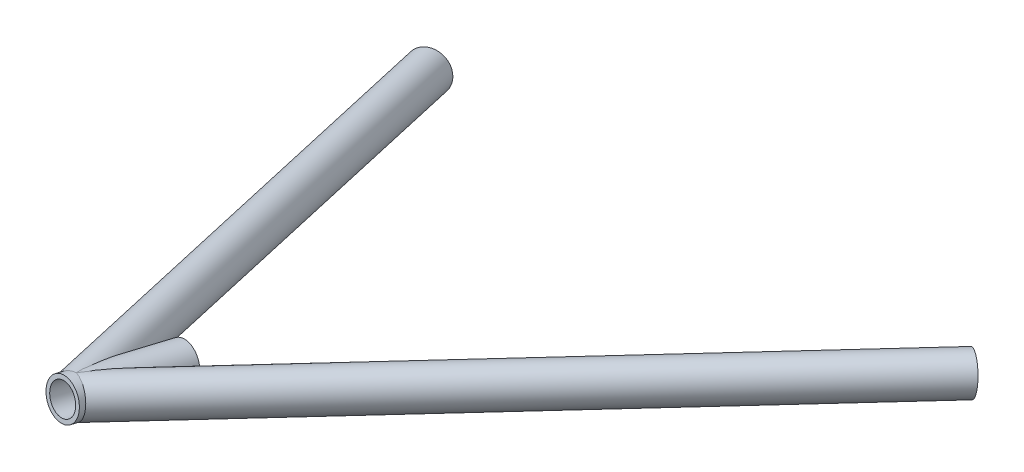
ISO-10303-21;
HEADER;
FILE_DESCRIPTION(('STEP AP214'),'2;1');
FILE_NAME('part.step','',(''),(''),'','','');
FILE_SCHEMA(('AUTOMOTIVE_DESIGN { 1 0 10303 214 1 1 1 1 }'));
ENDSEC;
DATA;
#1=APPLICATION_CONTEXT('core data for automotive mechanical design processes');
#2=APPLICATION_PROTOCOL_DEFINITION('international standard','automotive_design',2000,#1);
#3=PRODUCT_CONTEXT('',#1,'mechanical');
#4=PRODUCT('Part','Part','',(#3));
#5=PRODUCT_RELATED_PRODUCT_CATEGORY('part','',(#4));
#6=PRODUCT_DEFINITION_FORMATION('','',#4);
#7=PRODUCT_DEFINITION_CONTEXT('part definition',#1,'design');
#8=PRODUCT_DEFINITION('design','',#6,#7);
#9=PRODUCT_DEFINITION_SHAPE('','',#8);
#10=(LENGTH_UNIT() NAMED_UNIT(*) SI_UNIT(.MILLI.,.METRE.));
#11=(NAMED_UNIT(*) PLANE_ANGLE_UNIT() SI_UNIT($,.RADIAN.));
#12=(NAMED_UNIT(*) SI_UNIT($,.STERADIAN.) SOLID_ANGLE_UNIT());
#13=UNCERTAINTY_MEASURE_WITH_UNIT(LENGTH_MEASURE(1.E-05),#10,'distance_accuracy_value','');
#14=(GEOMETRIC_REPRESENTATION_CONTEXT(3) GLOBAL_UNCERTAINTY_ASSIGNED_CONTEXT((#13)) GLOBAL_UNIT_ASSIGNED_CONTEXT((#10,
#11,#12)) REPRESENTATION_CONTEXT('',''));
#15=CARTESIAN_POINT('',(0.,0.,0.));
#16=DIRECTION('',(0.,0.,1.));
#17=DIRECTION('',(1.,0.,0.));
#18=AXIS2_PLACEMENT_3D('',#15,#16,#17);
#19=CARTESIAN_POINT('',(4.04397858951075,301.981612494775,650.872201759846));
#20=DIRECTION('',(0.537160814672258,-0.118768279923982,-0.835076256915819));
#21=DIRECTION('',(-0.841029061630512,0.,-0.540989942136544));
#22=AXIS2_PLACEMENT_3D('',#19,#20,#21);
#23=CYLINDRICAL_SURFACE('',#22,7.41679999999997);
#24=CARTESIAN_POINT('',(181.199371486471,262.811887676954,375.464431215176));
#25=DIRECTION('',(-0.537160814672258,0.118768279923982,0.835076256915819));
#26=DIRECTION('',(0.841029061630512,0.,0.540989942136543));
#27=AXIS2_PLACEMENT_3D('',#24,#25,#26);
#28=CIRCLE('',#27,7.41679999999997);
#29=CARTESIAN_POINT('',(187.437115830772,262.811887676954,379.476845418014));
#30=VERTEX_POINT('',#29);
#31=EDGE_CURVE('E109',#30,#30,#28,.T.);
#32=ORIENTED_EDGE('',*,*,#31,.F.);
#33=EDGE_LOOP('',(#32));
#34=FACE_BOUND('',#33,.T.);
#35=CARTESIAN_POINT('',(18.0259893730203,297.510948456335,615.425928335186));
#36=CARTESIAN_POINT('',(18.0392009230547,297.391181249334,615.4053989557));
#37=CARTESIAN_POINT('',(18.049379106641,297.269192682269,615.394643104518));
#38=CARTESIAN_POINT('',(18.0623771955097,297.024848893247,615.395952968748));
#39=CARTESIAN_POINT('',(18.06519601463,296.902493619836,615.408022052419));
#40=CARTESIAN_POINT('',(18.0631446437854,296.662477211055,615.455138321569));
#41=CARTESIAN_POINT('',(18.0582796529336,296.544812956811,615.490169960463));
#42=CARTESIAN_POINT('',(18.0416756858454,296.317868608693,615.58008254422));
#43=CARTESIAN_POINT('',(18.0299260387503,296.208601828507,615.634994251557));
#44=CARTESIAN_POINT('',(17.9965826357287,295.968773124247,615.778938372833));
#45=CARTESIAN_POINT('',(17.9730897345507,295.841710660102,615.873266291217));
#46=CARTESIAN_POINT('',(17.9197422240915,295.603899976413,616.078980624299));
#47=CARTESIAN_POINT('',(17.8898736862353,295.493188388632,616.190404234864));
#48=CARTESIAN_POINT('',(17.8275120366974,295.291093662526,616.418282505348));
#49=CARTESIAN_POINT('',(17.7952315748672,295.199011169215,616.534187563074));
#50=CARTESIAN_POINT('',(17.7279462334323,295.025261820128,616.772888114363));
#51=CARTESIAN_POINT('',(17.692938744839,294.943605140931,616.895690174271));
#52=CARTESIAN_POINT('',(17.620894661041,294.788818403219,617.146389147038));
#53=CARTESIAN_POINT('',(17.5838530632472,294.715710889433,617.274298388449));
#54=CARTESIAN_POINT('',(17.5083523726395,294.576878159229,617.53354024883));
#55=CARTESIAN_POINT('',(17.4698939088278,294.511149718176,617.664871341302));
#56=CARTESIAN_POINT('',(17.3656042528833,294.343650096037,618.019563112275));
#57=CARTESIAN_POINT('',(17.298801180808,294.24745909781,618.24526830367));
#58=CARTESIAN_POINT('',(17.1632389097918,294.068548963037,618.701432507359));
#59=CARTESIAN_POINT('',(17.0944785846952,293.985837774328,618.931894234593));
#60=CARTESIAN_POINT('',(16.9555367997195,293.831169639357,619.396480467915));
#61=CARTESIAN_POINT('',(16.8853528544155,293.759233744994,619.630611181744));
#62=CARTESIAN_POINT('',(16.7441163542546,293.624403841432,620.101208439363));
#63=CARTESIAN_POINT('',(16.6730636982798,293.561510895916,620.337675254449));
#64=CARTESIAN_POINT('',(16.5300291670172,293.443074322862,620.813551004494));
#65=CARTESIAN_POINT('',(16.458044393262,293.387570110842,621.052968813209));
#66=CARTESIAN_POINT('',(16.3137273383495,293.28322583845,621.53314758715));
#67=CARTESIAN_POINT('',(16.2413950423059,293.234386066235,621.773908609987));
#68=CARTESIAN_POINT('',(16.0243304399387,293.096696071643,622.497142697111));
#69=CARTESIAN_POINT('',(15.8793409293532,293.016523891741,622.981195597616));
#70=CARTESIAN_POINT('',(15.563202463854,292.861599362073,624.040978545665));
#71=CARTESIAN_POINT('',(15.3921278067244,292.790531373747,624.617256246227));
#72=CARTESIAN_POINT('',(15.0517610779049,292.669278219643,625.772592750415));
#73=CARTESIAN_POINT('',(14.8824693232943,292.619096709261,626.351652022929));
#74=CARTESIAN_POINT('',(14.546667293014,292.536462920992,627.512621813292));
#75=CARTESIAN_POINT('',(14.3801608537045,292.504033411516,628.094535031451));
#76=CARTESIAN_POINT('',(14.051431917114,292.454994085379,629.260174503447));
#77=CARTESIAN_POINT('',(13.8892090857078,292.4383830313,629.843900611884));
#78=CARTESIAN_POINT('',(13.5711219110217,292.419823964543,631.010997751313));
#79=CARTESIAN_POINT('',(13.4152362896875,292.417822003584,631.594362126013));
#80=CARTESIAN_POINT('',(13.1110723780713,292.427863543567,632.763005472116));
#81=CARTESIAN_POINT('',(12.962794721003,292.439908211642,633.348284598584));
#82=CARTESIAN_POINT('',(12.6765234996167,292.478257381376,634.520275832957));
#83=CARTESIAN_POINT('',(12.5385193019929,292.504546899102,635.106985791365));
#84=CARTESIAN_POINT('',(12.3417938870989,292.555556279288,635.988619697626));
#85=CARTESIAN_POINT('',(12.277936128261,292.574486948643,636.282739578099));
#86=CARTESIAN_POINT('',(12.1542433083895,292.616487327866,636.871525918635));
#87=CARTESIAN_POINT('',(12.0944081591793,292.639556946967,637.166192366571));
#88=CARTESIAN_POINT('',(11.9600289486346,292.698749171385,637.85572611667));
#89=CARTESIAN_POINT('',(11.8873456926771,292.736648454893,638.250810467152));
#90=CARTESIAN_POINT('',(11.7525274778548,292.821778631757,639.041866355432));
#91=CARTESIAN_POINT('',(11.6903943502096,292.869011142037,639.437838035187));
#92=CARTESIAN_POINT('',(11.5794750694732,292.974727860035,640.230313522759));
#93=CARTESIAN_POINT('',(11.5306913396657,293.033214107339,640.626817414077));
#94=CARTESIAN_POINT('',(11.470343554994,293.131539272535,641.221076182981));
#95=CARTESIAN_POINT('',(11.4523665530691,293.166076993828,641.419063215714));
#96=CARTESIAN_POINT('',(11.4212609410856,293.239185884249,641.814667454382));
#97=CARTESIAN_POINT('',(11.4081320379369,293.27775680937,642.012284681955));
#98=CARTESIAN_POINT('',(11.3836671576796,293.373983487733,642.476735145353));
#99=CARTESIAN_POINT('',(11.3746116949344,293.433561302975,642.743302696478));
#100=CARTESIAN_POINT('',(11.3682948089143,293.562972324594,643.274164444859));
#101=CARTESIAN_POINT('',(11.3710346788846,293.632806654688,643.538458389653));
#102=CARTESIAN_POINT('',(11.3901826404233,293.784818610712,644.062448751672));
#103=CARTESIAN_POINT('',(11.4065623411157,293.866970307445,644.322153575299));
#104=CARTESIAN_POINT('',(11.4547428616655,294.046367314067,644.834848924092));
#105=CARTESIAN_POINT('',(11.4865364051065,294.143605487367,645.087842558034));
#106=CARTESIAN_POINT('',(11.5549147493514,294.324768047379,645.510473998685));
#107=CARTESIAN_POINT('',(11.5873322808602,294.404182129703,645.682721295324));
#108=CARTESIAN_POINT('',(11.6604911919953,294.572921566891,646.020439354004));
#109=CARTESIAN_POINT('',(11.7012298817969,294.662243714708,646.18591228517));
#110=CARTESIAN_POINT('',(11.7906581033069,294.851549362705,646.508223893678));
#111=CARTESIAN_POINT('',(11.8393406372267,294.951523452854,646.665070009299));
#112=CARTESIAN_POINT('',(11.9438288702849,295.162741771333,646.968493413005));
#113=CARTESIAN_POINT('',(11.9996345085449,295.273985903342,647.115070788835));
#114=CARTESIAN_POINT('',(12.1173731324617,295.508672974601,647.39721363735));
#115=CARTESIAN_POINT('',(12.1793428592063,295.632189055164,647.532703077649));
#116=CARTESIAN_POINT('',(12.3072756051872,295.890609327443,647.790288659604));
#117=CARTESIAN_POINT('',(12.3732387464868,296.02551386731,647.912384391545));
#118=CARTESIAN_POINT('',(12.5071009026746,296.30622592416,648.14236901447));
#119=CARTESIAN_POINT('',(12.5750012948688,296.452041324178,648.250247475103));
#120=CARTESIAN_POINT('',(12.7105107236756,296.753620990599,648.451253342594));
#121=CARTESIAN_POINT('',(12.7781197686254,296.909384970267,648.54438117432));
#122=CARTESIAN_POINT('',(12.9053835786029,297.216345003063,648.708635413285));
#123=CARTESIAN_POINT('',(12.9652297478743,297.366827559972,648.780952279324));
#124=CARTESIAN_POINT('',(13.0814750650284,297.674352647588,648.913329403656));
#125=CARTESIAN_POINT('',(13.1378744622686,297.831394702358,648.973390549331));
#126=CARTESIAN_POINT('',(13.2459558550857,298.151114517152,649.081544727949));
#127=CARTESIAN_POINT('',(13.2976378372984,298.31379229314,649.129637726989));
#128=CARTESIAN_POINT('',(13.3952051458348,298.643841112701,649.214205400618));
#129=CARTESIAN_POINT('',(13.441090135971,298.811212427783,649.250679401568));
#130=CARTESIAN_POINT('',(13.5288574832356,299.160401496814,649.314323677058));
#131=CARTESIAN_POINT('',(13.5703029443316,299.342463296291,649.340759342042));
#132=CARTESIAN_POINT('',(13.6447657558027,299.70965408605,649.381328645444));
#133=CARTESIAN_POINT('',(13.6777828414342,299.894783172485,649.395461897466));
#134=CARTESIAN_POINT('',(13.7347467915508,300.26699078181,649.411812749685));
#135=CARTESIAN_POINT('',(13.758691794149,300.454069696784,649.414027905132));
#136=CARTESIAN_POINT('',(13.7970486877606,300.828982939074,649.406868787367));
#137=CARTESIAN_POINT('',(13.8114602965379,301.01681728859,649.397494171064));
#138=CARTESIAN_POINT('',(13.8309587333078,301.401581022214,649.366666461392));
#139=CARTESIAN_POINT('',(13.8355366740282,301.598489549477,649.34462604006));
#140=CARTESIAN_POINT('',(13.8337607085808,301.9905014218,649.288295516682));
#141=CARTESIAN_POINT('',(13.8274064049574,302.185604700969,649.254004969303));
#142=CARTESIAN_POINT('',(13.8038678608829,302.572672588593,649.173332003037));
#143=CARTESIAN_POINT('',(13.7866815731982,302.764636596692,649.126947299339));
#144=CARTESIAN_POINT('',(13.7417950399094,303.144007762921,649.022179296996));
#145=CARTESIAN_POINT('',(13.7140948250639,303.331414934382,648.963796033454));
#146=CARTESIAN_POINT('',(13.6483939375111,303.702122579301,648.834406375262));
#147=CARTESIAN_POINT('',(13.6102933945019,303.88536353833,648.76328001579));
#148=CARTESIAN_POINT('',(13.5247185082023,304.244338133499,648.608757825874));
#149=CARTESIAN_POINT('',(13.477244017158,304.420071651253,648.52536180204));
#150=CARTESIAN_POINT('',(13.373992291517,304.762569288793,648.346209796664));
#151=CARTESIAN_POINT('',(13.3182153847532,304.929333762381,648.250454303173));
#152=CARTESIAN_POINT('',(13.1997162137712,305.252448661401,648.046472659108));
#153=CARTESIAN_POINT('',(13.1369941772474,305.408799427974,647.938246917363));
#154=CARTESIAN_POINT('',(13.0079807472715,305.705736241056,647.712250351754));
#155=CARTESIAN_POINT('',(12.9418256091205,305.846627647483,647.59480319643));
#156=CARTESIAN_POINT('',(12.8063252704746,306.115959344151,647.348055863197));
#157=CARTESIAN_POINT('',(12.7369801487349,306.244399941537,647.218755977834));
#158=CARTESIAN_POINT('',(12.5972245605859,306.487624851574,646.948669395698));
#159=CARTESIAN_POINT('',(12.5268151987456,306.602422356299,646.807894020864));
#160=CARTESIAN_POINT('',(12.3870749633705,306.817660822114,646.515272129223));
#161=CARTESIAN_POINT('',(12.3177440058268,306.91810290655,646.363426480097));
#162=CARTESIAN_POINT('',(12.187204266398,307.097517916396,646.060748085196));
#163=CARTESIAN_POINT('',(12.1257689621684,307.177511507652,645.910616592422));
#164=CARTESIAN_POINT('',(12.0073617238849,307.324690296442,645.602541218296));
#165=CARTESIAN_POINT('',(11.9503894179186,307.391876561913,645.444597989707));
#166=CARTESIAN_POINT('',(11.8422612739717,307.513782780615,645.122088728321));
#167=CARTESIAN_POINT('',(11.7911047326352,307.568504242139,644.957523499652));
#168=CARTESIAN_POINT('',(11.6955621068052,307.666185719994,644.623031226127));
#169=CARTESIAN_POINT('',(11.6511769529345,307.709144120317,644.453103448139));
#170=CARTESIAN_POINT('',(11.5562273899794,307.796714592838,644.052034572754));
#171=CARTESIAN_POINT('',(11.508504229024,307.83714011634,643.819301773671));
#172=CARTESIAN_POINT('',(11.426372932171,307.901437123905,643.349259932401));
#173=CARTESIAN_POINT('',(11.3919700818443,307.925302039599,643.111949112764));
#174=CARTESIAN_POINT('',(11.3357964940907,307.959215673984,642.63434225165));
#175=CARTESIAN_POINT('',(11.3140562593375,307.96923111001,642.394040414363));
#176=CARTESIAN_POINT('',(11.2822138290264,307.977808650157,641.912553650223));
#177=CARTESIAN_POINT('',(11.2721103959542,307.97637197228,641.67136882001));
#178=CARTESIAN_POINT('',(11.2609650047204,307.9626033566,641.127982475222));
#179=CARTESIAN_POINT('',(11.2628654957441,307.947604593592,640.825795463397));
#180=CARTESIAN_POINT('',(11.2803047822254,307.906164362887,640.222546893591));
#181=CARTESIAN_POINT('',(11.2958500310743,307.879717483717,639.921485935857));
#182=CARTESIAN_POINT('',(11.3383398883103,307.817706795311,639.320600353298));
#183=CARTESIAN_POINT('',(11.3653050759216,307.782126573212,639.02077895199));
#184=CARTESIAN_POINT('',(11.4287010459255,307.703622419329,638.42318343931));
#185=CARTESIAN_POINT('',(11.4651303890478,307.660699604515,638.125409023702));
#186=CARTESIAN_POINT('',(11.5462096236828,307.568378875036,637.529410987154));
#187=CARTESIAN_POINT('',(11.5909257767127,307.518929765035,637.231204472079));
#188=CARTESIAN_POINT('',(11.6870548657426,307.414766469799,636.636803034188));
#189=CARTESIAN_POINT('',(11.7384679733657,307.360052149641,636.340608163129));
#190=CARTESIAN_POINT('',(11.8468591948296,307.24609197885,635.750486583504));
#191=CARTESIAN_POINT('',(11.9038308719929,307.186851386371,635.456557666955));
#192=CARTESIAN_POINT('',(12.0225233012161,307.064259457315,634.870528460908));
#193=CARTESIAN_POINT('',(12.0842440531249,307.000908120869,634.578428171352));
#194=CARTESIAN_POINT('',(12.2184611596817,306.863538311854,633.965181365808));
#195=CARTESIAN_POINT('',(12.2914069656672,306.789100061657,633.644227508919));
#196=CARTESIAN_POINT('',(12.441461988527,306.635913534411,633.004324054833));
#197=CARTESIAN_POINT('',(12.5185713428966,306.557165115023,632.685374524215));
#198=CARTESIAN_POINT('',(12.7551826990239,306.314740685158,631.731315983409));
#199=CARTESIAN_POINT('',(12.9199521729491,306.144901487568,631.099067891332));
#200=CARTESIAN_POINT('',(13.2599677612956,305.788975297079,629.840756650357));
#201=CARTESIAN_POINT('',(13.4352318327593,305.602860189012,629.214706369674));
#202=CARTESIAN_POINT('',(13.7932579710048,305.214016232643,627.970038393295));
#203=CARTESIAN_POINT('',(13.9760191405481,305.011289369524,627.351419819577));
#204=CARTESIAN_POINT('',(14.3452017680405,304.589678406339,626.128069053151));
#205=CARTESIAN_POINT('',(14.5315701650489,304.370971109374,625.523260275809));
#206=CARTESIAN_POINT('',(14.8139307637117,304.02745668686,624.6227274501));
#207=CARTESIAN_POINT('',(14.9085343518049,303.910356292052,624.323615826375));
#208=CARTESIAN_POINT('',(15.0984779122026,303.670518834585,623.727900343464));
#209=CARTESIAN_POINT('',(15.1938178634639,303.547781932507,623.431296413119));
#210=CARTESIAN_POINT('',(15.3848279575733,303.296351351947,622.841565050507));
#211=CARTESIAN_POINT('',(15.480496914537,303.167671355233,622.548431411254));
#212=CARTESIAN_POINT('',(15.6721587563683,302.903352225973,621.965436136662));
#213=CARTESIAN_POINT('',(15.7681516240351,302.767713457694,621.675574331022));
#214=CARTESIAN_POINT('',(15.9601786521053,302.488559756385,621.099861321316));
#215=CARTESIAN_POINT('',(16.0562127698196,302.345048680094,620.814008238013));
#216=CARTESIAN_POINT('',(16.2480657583436,302.048824611076,620.247057412478));
#217=CARTESIAN_POINT('',(16.3438846562762,301.896112854182,619.965959038063));
#218=CARTESIAN_POINT('',(16.5007724105263,301.636276128116,619.509191365899));
#219=CARTESIAN_POINT('',(16.5620197729741,301.532368346773,619.331752716318));
#220=CARTESIAN_POINT('',(16.6841330910256,301.31939311484,618.979814257614));
#221=CARTESIAN_POINT('',(16.7449989877478,301.210324888888,618.805314895497));
#222=CARTESIAN_POINT('',(16.8664289891661,300.98577901384,618.459144789293));
#223=CARTESIAN_POINT('',(16.9269904759811,300.870274557181,618.287490448721));
#224=CARTESIAN_POINT('',(17.0472615114838,300.63234713766,617.948769242178));
#225=CARTESIAN_POINT('',(17.1069712313438,300.509925590115,617.781701448066));
#226=CARTESIAN_POINT('',(17.2258774278961,300.25536827208,617.451488817069));
#227=CARTESIAN_POINT('',(17.2850595415654,300.123134945401,617.288413504024));
#228=CARTESIAN_POINT('',(17.4016610311343,299.848347429108,616.97013954836));
#229=CARTESIAN_POINT('',(17.4590786464364,299.705783379173,616.81494867798));
#230=CARTESIAN_POINT('',(17.5708662190597,299.408832466774,616.516614372798));
#231=CARTESIAN_POINT('',(17.6252497345914,299.254506976522,616.373415617786));
#232=CARTESIAN_POINT('',(17.7295842627494,298.930641743062,616.103831748072));
#233=CARTESIAN_POINT('',(17.7795458072694,298.761140196122,615.977406304535));
#234=CARTESIAN_POINT('',(17.86111838538,298.446195118441,615.777748005667));
#235=CARTESIAN_POINT('',(17.8942611916319,298.304685323759,615.69902386072));
#236=CARTESIAN_POINT('',(17.953971389663,298.010431036427,615.563990476506));
#237=CARTESIAN_POINT('',(17.9805769467949,297.857758849595,615.507549908532));
#238=CARTESIAN_POINT('',(18.0110423998854,297.638002947985,615.450592182051));
#239=CARTESIAN_POINT('',(18.0189468529607,297.574791302601,615.43687168146));
#240=CARTESIAN_POINT('',(18.0259893730203,297.510948456335,615.425928335186));
#241=B_SPLINE_CURVE_WITH_KNOTS('',3,(#35,#36,#37,#38,#39,#40,#41,#42,#43,#44,#45,#46,#47,#48,
#49,#50,#51,#52,#53,#54,#55,#56,#57,#58,#59,#60,#61,#62,#63,#64,#65,#66,#67,#68,#69,#70,#71,#72,
#73,#74,#75,#76,#77,#78,#79,#80,#81,#82,#83,#84,#85,#86,#87,#88,#89,#90,#91,#92,#93,#94,#95,#96,
#97,#98,#99,#100,#101,#102,#103,#104,#105,#106,#107,#108,#109,#110,#111,#112,#113,#114,#115,
#116,#117,#118,#119,#120,#121,#122,#123,#124,#125,#126,#127,#128,#129,#130,#131,#132,#133,#134,
#135,#136,#137,#138,#139,#140,#141,#142,#143,#144,#145,#146,#147,#148,#149,#150,#151,#152,#153,
#154,#155,#156,#157,#158,#159,#160,#161,#162,#163,#164,#165,#166,#167,#168,#169,#170,#171,#172,
#173,#174,#175,#176,#177,#178,#179,#180,#181,#182,#183,#184,#185,#186,#187,#188,#189,#190,#191,
#192,#193,#194,#195,#196,#197,#198,#199,#200,#201,#202,#203,#204,#205,#206,#207,#208,#209,#210,
#211,#212,#213,#214,#215,#216,#217,#218,#219,#220,#221,#222,#223,#224,#225,#226,#227,#228,#229,
#230,#231,#232,#233,#234,#235,#236,#237,#238,#239,#240),.UNSPECIFIED.,.T.,.F.,(4,2,2,2,2,2,2,2,
2,2,2,2,2,2,2,2,2,2,2,2,2,2,2,2,2,2,2,2,2,2,2,2,2,2,2,2,2,2,2,2,2,2,2,2,2,2,2,2,2,2,2,2,2,2,2,2,
2,2,2,2,2,2,2,2,2,2,2,2,2,2,2,2,2,2,2,2,2,2,2,2,2,2,2,2,2,2,2,2,2,2,2,2,2,2,2,2,2,2,2,2,2,2,4),
(0.,0.366426411934708,0.73290690135951,1.09913952450715,1.46594129632992,1.94322967318515,
2.42157163259857,2.87542474857674,3.32971753530915,3.78518252473583,4.24044769595332,
5.00268399978702,5.76536811281952,6.52952338794362,7.2937684739434,8.06193971685634,
8.8301441636213,10.364533379538,12.1800531532704,13.995890532235,15.8140514484965,
17.6320701251144,19.4433718311585,21.2548240488184,23.0643745169353,23.9690296120688,
24.8736648704264,26.0839476972957,27.2944403825808,28.5051526601129,29.1104085392524,
29.7156278218809,30.535125126655,31.3547122837529,32.1725977478725,32.9900974880185,
33.5668858956185,34.1434881498791,34.7195851863437,35.2956772994776,35.8754363865321,
36.455213203531,37.0354130275454,37.6155961367506,38.1470940861742,38.6785535386266,
39.210014496625,39.741506261734,40.3066237532496,40.8717589934907,41.4370101551506,
42.0022780503297,42.5961565976837,43.1900567366995,43.7840691558873,44.3780798372981,
44.9780084278713,45.5779464753879,46.1778608397589,46.7777555419164,47.3619607313538,
47.9461515055129,48.5297727244397,49.113348248606,49.6552714107253,50.1971493649192,
50.7389617147667,51.28084846142,52.0026521151869,52.7247418917162,53.448563975134,
54.1723090766559,55.0793243153878,55.9867687651245,56.8958554742071,57.8048040139135,
58.7213613670174,59.6379422133901,60.5534740034783,61.4690057644014,62.4812912474417,
63.4936101802627,65.5184709728118,67.5469013609829,69.5750896946762,71.5835033619183,
72.5880322542247,73.5925325455868,74.5948255935203,75.59706622851,76.5988201644497,
77.6004398438126,78.2440285653986,78.8877142959967,79.534317235536,80.1807883483635,
80.8348853894417,81.4896151826048,82.1411359346856,82.7910606644522,83.2856362245701,
83.7772518556355,83.9725783199543),.UNSPECIFIED.);
#242=CARTESIAN_POINT('',(18.0259893730203,297.510948456335,615.425928335186));
#243=VERTEX_POINT('',#242);
#244=EDGE_CURVE('E83',#243,#243,#241,.T.);
#245=ORIENTED_EDGE('',*,*,#244,.T.);
#246=EDGE_LOOP('',(#245));
#247=FACE_BOUND('',#246,.T.);
#248=ADVANCED_FACE('F65',(#34,#247),#23,.F.);
#249=CARTESIAN_POINT('',(10.1712188766484,294.809656352147,601.770063603224));
#250=DIRECTION('',(-0.122544805742753,0.143439122852553,0.982042763132422));
#251=DIRECTION('',(0.,-0.989500647349858,0.144528436282319));
#252=AXIS2_PLACEMENT_3D('',#249,#250,#251);
#253=CYLINDRICAL_SURFACE('',#252,9.52500000000002);
#254=ORIENTED_EDGE('',*,*,#244,.F.);
#255=EDGE_LOOP('',(#254));
#256=FACE_BOUND('',#255,.T.);
#257=CARTESIAN_POINT('',(4.04397858951081,301.981612494775,650.872201759846));
#258=DIRECTION('',(0.941060120574561,0.0559957790365611,0.333572064469255));
#259=DIRECTION('',(0.338160058557685,-0.134405510478131,-0.931441320507833));
#260=AXIS2_PLACEMENT_3D('',#257,#258,#259);
#261=ELLIPSE('',#260,43.2380682628043,9.52500000000002);
#262=CARTESIAN_POINT('',(3.97422835979852,311.405104857805,649.487083862563));
#263=VERTEX_POINT('',#262);
#264=CARTESIAN_POINT('',(4.1137288192231,292.558120131745,652.257319657128));
#265=VERTEX_POINT('',#264);
#266=EDGE_CURVE('E74',#263,#265,#261,.F.);
#267=ORIENTED_EDGE('',*,*,#266,.T.);
#268=CARTESIAN_POINT('',(4.04397858951081,301.981612494775,650.872201759846));
#269=DIRECTION('',(0.338160058557685,-0.134405510478131,-0.931441320507833));
#270=DIRECTION('',(0.941060120574561,0.0559957790365611,0.333572064469255));
#271=AXIS2_PLACEMENT_3D('',#268,#269,#270);
#272=ELLIPSE('',#271,9.76488439111886,9.52500000000002);
#273=EDGE_CURVE('E13',#265,#263,#272,.F.);
#274=ORIENTED_EDGE('',*,*,#273,.T.);
#275=EDGE_LOOP('',(#267,#274));
#276=FACE_BOUND('',#275,.T.);
#277=ADVANCED_FACE('F81',(#256,#276),#253,.F.);
#278=CARTESIAN_POINT('',(4.04397858951075,301.981612494775,650.872201759846));
#279=DIRECTION('',(0.537160814672258,-0.118768279923982,-0.835076256915819));
#280=DIRECTION('',(-0.841029061630512,0.,-0.540989942136544));
#281=AXIS2_PLACEMENT_3D('',#278,#279,#280);
#282=CYLINDRICAL_SURFACE('',#281,9.52500000000003);
#283=CARTESIAN_POINT('',(181.199371486471,262.811887676954,375.464431215176));
#284=DIRECTION('',(-0.537160814672258,0.118768279923982,0.835076256915819));
#285=DIRECTION('',(0.841029061630512,0.,0.540989942136543));
#286=AXIS2_PLACEMENT_3D('',#283,#284,#285);
#287=CIRCLE('',#286,9.52500000000003);
#288=CARTESIAN_POINT('',(189.210173298502,262.811887676954,380.617360414027));
#289=VERTEX_POINT('',#288);
#290=EDGE_CURVE('E69',#289,#289,#287,.T.);
#291=ORIENTED_EDGE('',*,*,#290,.T.);
#292=EDGE_LOOP('',(#291));
#293=FACE_BOUND('',#292,.T.);
#294=ORIENTED_EDGE('',*,*,#266,.F.);
#295=ORIENTED_EDGE('',*,*,#273,.F.);
#296=EDGE_LOOP('',(#294,#295));
#297=FACE_BOUND('',#296,.T.);
#298=ADVANCED_FACE('F67',(#293,#297),#282,.T.);
#299=CARTESIAN_POINT('',(181.199371486471,262.811887676954,375.464431215176));
#300=DIRECTION('',(-0.537160814672258,0.118768279923982,0.835076256915819));
#301=DIRECTION('',(0.841029061630512,0.,0.540989942136543));
#302=AXIS2_PLACEMENT_3D('',#299,#300,#301);
#303=PLANE('',#302);
#304=ORIENTED_EDGE('',*,*,#31,.T.);
#305=EDGE_LOOP('',(#304));
#306=FACE_BOUND('',#305,.T.);
#307=ORIENTED_EDGE('',*,*,#290,.F.);
#308=EDGE_LOOP('',(#307));
#309=FACE_BOUND('',#308,.T.);
#310=ADVANCED_FACE('F86',(#306,#309),#303,.F.);
#311=CLOSED_SHELL('',(#248,#277,#298,#310));
#312=MANIFOLD_SOLID_BREP('B2',#311);
#313=CARTESIAN_POINT('',(-99.9999999999999,256.434476218686,346.236762223122));
#314=DIRECTION('',(0.320018024842971,0.140093687168908,0.936996383446075));
#315=DIRECTION('',(0.946328839633178,0.,-0.323205394878431));
#316=AXIS2_PLACEMENT_3D('',#313,#314,#315);
#317=CYLINDRICAL_SURFACE('',#316,7.41679999999997);
#318=CARTESIAN_POINT('',(-88.7993691304959,261.337755269598,379.031635643735));
#319=DIRECTION('',(0.320018024842971,0.140093687168908,0.936996383446075));
#320=DIRECTION('',(0.946328839633178,0.,-0.323205394878431));
#321=AXIS2_PLACEMENT_3D('',#318,#319,#320);
#322=CIRCLE('',#321,7.41679999999997);
#323=CARTESIAN_POINT('',(-81.7806373927046,261.337755269598,376.634485871));
#324=VERTEX_POINT('',#323);
#325=EDGE_CURVE('E184',#324,#324,#322,.T.);
#326=ORIENTED_EDGE('',*,*,#325,.F.);
#327=EDGE_LOOP('',(#326));
#328=FACE_BOUND('',#327,.T.);
#329=CARTESIAN_POINT('',(-0.888888857109953,296.749583461002,613.48138180967));
#330=CARTESIAN_POINT('',(-0.888560553987267,296.825460430329,613.482344738953));
#331=CARTESIAN_POINT('',(-0.887902174840742,296.901312382579,613.487806639));
#332=CARTESIAN_POINT('',(-0.885981385085939,297.0519732914,613.507035260747));
#333=CARTESIAN_POINT('',(-0.884718258848478,297.126780903932,613.520811826676));
#334=CARTESIAN_POINT('',(-0.880117404144003,297.349259178406,613.57337974887));
#335=CARTESIAN_POINT('',(-0.875972144200541,297.494325132679,613.623386674901));
#336=CARTESIAN_POINT('',(-0.867659731153033,297.731941777742,613.726506202707));
#337=CARTESIAN_POINT('',(-0.863879961500112,297.827083751218,613.774084356514));
#338=CARTESIAN_POINT('',(-0.85575358963688,298.01275211883,613.877520145806));
#339=CARTESIAN_POINT('',(-0.851406913154636,298.103277906023,613.933378866281));
#340=CARTESIAN_POINT('',(-0.842277327003536,298.279974437861,614.051657215357));
#341=CARTESIAN_POINT('',(-0.83749401223167,298.36614102057,614.114082945033));
#342=CARTESIAN_POINT('',(-0.827596191122819,298.534395900238,614.24411119319));
#343=CARTESIAN_POINT('',(-0.822481759214172,298.616485106427,614.311712548917));
#344=CARTESIAN_POINT('',(-0.810120441346757,298.805728366098,614.476046670399));
#345=CARTESIAN_POINT('',(-0.802765516547744,298.911337097892,614.574545760657));
#346=CARTESIAN_POINT('',(-0.787721430675265,299.11672057491,614.777452571634));
#347=CARTESIAN_POINT('',(-0.78003212693174,299.21649278642,614.88186282033));
#348=CARTESIAN_POINT('',(-0.764406658785229,299.411089537504,615.095462712776));
#349=CARTESIAN_POINT('',(-0.756470121981084,299.505905973855,615.20465967845));
#350=CARTESIAN_POINT('',(-0.740432095982114,299.691070914465,615.426777349389));
#351=CARTESIAN_POINT('',(-0.732330576810755,299.781418596361,615.539698733716));
#352=CARTESIAN_POINT('',(-0.707775456252871,300.047522479253,615.884211101211));
#353=CARTESIAN_POINT('',(-0.691155103477002,300.217323187595,616.120405928881));
#354=CARTESIAN_POINT('',(-0.666136525066289,300.462451252219,616.480884798047));
#355=CARTESIAN_POINT('',(-0.65778629047552,300.54252952627,616.602016829441));
#356=CARTESIAN_POINT('',(-0.641077262048758,300.699837161769,616.846121880463));
#357=CARTESIAN_POINT('',(-0.632718468271695,300.777066542696,616.969094887494));
#358=CARTESIAN_POINT('',(-0.609244930777645,300.990522686071,617.316970545332));
#359=CARTESIAN_POINT('',(-0.594147494494951,301.123814299998,617.543675871678));
#360=CARTESIAN_POINT('',(-0.56411243942792,301.38321135413,618.001188105067));
#361=CARTESIAN_POINT('',(-0.549174842713218,301.509315812117,618.231995567092));
#362=CARTESIAN_POINT('',(-0.519543631648266,301.755331995766,618.697031421875));
#363=CARTESIAN_POINT('',(-0.50485013234134,301.87524085464,618.931261335071));
#364=CARTESIAN_POINT('',(-0.475791718337932,302.109547749807,619.402486986824));
#365=CARTESIAN_POINT('',(-0.46142682133973,302.223945489642,619.639482873322));
#366=CARTESIAN_POINT('',(-0.418870748030325,302.56028083409,620.355007757066));
#367=CARTESIAN_POINT('',(-0.39128353897405,302.774828924035,620.837054437175));
#368=CARTESIAN_POINT('',(-0.338280564760777,303.187667003892,621.807973708428));
#369=CARTESIAN_POINT('',(-0.312864269700514,303.385960960832,622.296844599742));
#370=CARTESIAN_POINT('',(-0.26472459311584,303.769054300666,623.281097589358));
#371=CARTESIAN_POINT('',(-0.242006731479774,303.953825735595,623.776490807331));
#372=CARTESIAN_POINT('',(-0.199989673853791,304.311051699945,624.771864670681));
#373=CARTESIAN_POINT('',(-0.180690696704232,304.483505440498,625.271845607562));
#374=CARTESIAN_POINT('',(-0.146341991800403,304.816935214612,626.275018219416));
#375=CARTESIAN_POINT('',(-0.13128663463133,304.977926240102,626.778204726653));
#376=CARTESIAN_POINT('',(-0.106391230308692,305.289329675297,627.787949723642));
#377=CARTESIAN_POINT('',(-0.096550967662725,305.439742521879,628.294508073191));
#378=CARTESIAN_POINT('',(-0.0853684736291246,305.686439714581,629.157433281865));
#379=CARTESIAN_POINT('',(-0.0823584143787302,305.785368462441,629.513025074534));
#380=CARTESIAN_POINT('',(-0.0800743997030252,305.978151625632,630.225591852354));
#381=CARTESIAN_POINT('',(-0.0808003884669962,306.072006116742,630.582566816762));
#382=CARTESIAN_POINT('',(-0.0866667842991458,306.254558424456,631.298060797291));
#383=CARTESIAN_POINT('',(-0.0918102159345305,306.343252663464,631.656580703831));
#384=CARTESIAN_POINT('',(-0.107355674093121,306.515122406717,632.374828333296));
#385=CARTESIAN_POINT('',(-0.117757623501202,306.598297991873,632.73455603843));
#386=CARTESIAN_POINT('',(-0.144803468445097,306.758266856524,633.453381404091));
#387=CARTESIAN_POINT('',(-0.161417037538046,306.835088965133,633.812473744721));
#388=CARTESIAN_POINT('',(-0.202193268938213,306.982078219575,634.531637371896));
#389=CARTESIAN_POINT('',(-0.226356536929949,307.052244830874,634.891708734688));
#390=CARTESIAN_POINT('',(-0.283853260628612,307.184775153349,635.612239634208));
#391=CARTESIAN_POINT('',(-0.317178485097451,307.24714579572,635.972698534584));
#392=CARTESIAN_POINT('',(-0.395080477788453,307.362563013775,636.69386126582));
#393=CARTESIAN_POINT('',(-0.439654600973957,307.415611776415,637.05456501925));
#394=CARTESIAN_POINT('',(-0.527132280561848,307.495771738488,637.666704013242));
#395=CARTESIAN_POINT('',(-0.566477778083724,307.525878491294,637.918252622468));
#396=CARTESIAN_POINT('',(-0.653009420795055,307.579272711413,638.420756271467));
#397=CARTESIAN_POINT('',(-0.700195731429062,307.602560034805,638.671711298602));
#398=CARTESIAN_POINT('',(-0.803701798521187,307.640903858027,639.172921324412));
#399=CARTESIAN_POINT('',(-0.860039552482629,307.655943878103,639.423173934549));
#400=CARTESIAN_POINT('',(-0.983064926419874,307.675833622747,639.921587348852));
#401=CARTESIAN_POINT('',(-1.04975282735485,307.680683070636,640.16974809604));
#402=CARTESIAN_POINT('',(-1.19590124951656,307.677782199941,640.666692423633));
#403=CARTESIAN_POINT('',(-1.27555282354648,307.669824521426,640.915419814708));
#404=CARTESIAN_POINT('',(-1.44782829592942,307.637869484295,641.407411317305));
#405=CARTESIAN_POINT('',(-1.54045298350615,307.613871149506,641.650675095401));
#406=CARTESIAN_POINT('',(-1.73852287224344,307.546529592693,642.128117945089));
#407=CARTESIAN_POINT('',(-1.84391501021676,307.50326456508,642.362329620607));
#408=CARTESIAN_POINT('',(-2.06677817059399,307.394011843155,642.819422919151));
#409=CARTESIAN_POINT('',(-2.18424136414095,307.328038812016,643.042311747323));
#410=CARTESIAN_POINT('',(-2.39026505627518,307.195347911126,643.40597414377));
#411=CARTESIAN_POINT('',(-2.47636472277949,307.135326133523,643.550614076489));
#412=CARTESIAN_POINT('',(-2.65163884248032,307.00278276242,643.832094881923));
#413=CARTESIAN_POINT('',(-2.74081282428156,306.930263078507,643.968936941851));
#414=CARTESIAN_POINT('',(-2.92067577294864,306.772502863549,644.234146990977));
#415=CARTESIAN_POINT('',(-3.01136546941876,306.687256039829,644.362510742707));
#416=CARTESIAN_POINT('',(-3.19244356391282,306.504250109581,644.610226776026));
#417=CARTESIAN_POINT('',(-3.28283194663875,306.406490377394,644.729578606536));
#418=CARTESIAN_POINT('',(-3.46139709738542,306.199086290725,644.958931597354));
#419=CARTESIAN_POINT('',(-3.5495762546032,306.089455523805,645.068943196354));
#420=CARTESIAN_POINT('',(-3.72212151586972,305.85896678086,645.279801815299));
#421=CARTESIAN_POINT('',(-3.80648760076554,305.73810874845,645.380648789214));
#422=CARTESIAN_POINT('',(-3.96990052789728,305.486021132181,645.573421691661));
#423=CARTESIAN_POINT('',(-4.04894497249053,305.354786930519,645.665343607183));
#424=CARTESIAN_POINT('',(-4.20033278115582,305.083000892509,645.840513356375));
#425=CARTESIAN_POINT('',(-4.27267596860403,304.94244881074,645.923760961424));
#426=CARTESIAN_POINT('',(-4.4113415101626,304.64924619321,646.084007158328));
#427=CARTESIAN_POINT('',(-4.47745343714375,304.496373717142,646.160781612766));
#428=CARTESIAN_POINT('',(-4.60041333294139,304.183083669716,646.305876256255));
#429=CARTESIAN_POINT('',(-4.65726121483206,304.02266602758,646.374196365976));
#430=CARTESIAN_POINT('',(-4.7608932471625,303.695429173802,646.50267772907));
#431=CARTESIAN_POINT('',(-4.80767668127643,303.528609507498,646.562838401593));
#432=CARTESIAN_POINT('',(-4.89055534779395,303.189716194653,646.675216549686));
#433=CARTESIAN_POINT('',(-4.92664990692588,303.017642217904,646.727433524798));
#434=CARTESIAN_POINT('',(-4.98975254120468,302.657598195263,646.827324537186));
#435=CARTESIAN_POINT('',(-5.01598182497538,302.469339701804,646.874453183785));
#436=CARTESIAN_POINT('',(-5.05536336846064,302.089474408237,646.959865053435));
#437=CARTESIAN_POINT('',(-5.06851506236413,301.89786746362,646.998147893712));
#438=CARTESIAN_POINT('',(-5.08155772404986,301.512598155235,647.065811346509));
#439=CARTESIAN_POINT('',(-5.08144586866829,301.318935362648,647.09519006244));
#440=CARTESIAN_POINT('',(-5.0679467668633,300.9309111797,647.144852781192));
#441=CARTESIAN_POINT('',(-5.05455968537551,300.736549798049,647.165136897001));
#442=CARTESIAN_POINT('',(-5.0142013695595,300.343780294466,647.196684548385));
#443=CARTESIAN_POINT('',(-4.98691345584822,300.145386341017,647.207721164155));
#444=CARTESIAN_POINT('',(-4.91897292070895,299.750585080077,647.219497932184));
#445=CARTESIAN_POINT('',(-4.87831998747224,299.554177819045,647.2202378442));
#446=CARTESIAN_POINT('',(-4.78423151885551,299.164672724184,647.210842306118));
#447=CARTESIAN_POINT('',(-4.73079373919296,298.971575477788,647.200704945506));
#448=CARTESIAN_POINT('',(-4.61196337910778,298.590067809978,647.168853346183));
#449=CARTESIAN_POINT('',(-4.54657099918354,298.401657310021,647.14713930162));
#450=CARTESIAN_POINT('',(-4.40565239545024,298.032771892183,647.09162361686));
#451=CARTESIAN_POINT('',(-4.33023854123984,297.852234856018,647.057949932369));
#452=CARTESIAN_POINT('',(-4.1700973588098,297.49830346668,646.977640314663));
#453=CARTESIAN_POINT('',(-4.08537002916163,297.324909114603,646.93100437946));
#454=CARTESIAN_POINT('',(-3.90831084157144,296.986618385109,646.823972024722));
#455=CARTESIAN_POINT('',(-3.81598482221728,296.821715638514,646.763586108348));
#456=CARTESIAN_POINT('',(-3.62563133773704,296.501428161254,646.628296870462));
#457=CARTESIAN_POINT('',(-3.52760430601707,296.346042708898,646.55339465151));
#458=CARTESIAN_POINT('',(-3.33380000998979,296.054398153577,646.393287603787));
#459=CARTESIAN_POINT('',(-3.23821459823516,295.917553448388,646.308916753364));
#460=CARTESIAN_POINT('',(-3.0460144386148,295.653919589249,646.126718963716));
#461=CARTESIAN_POINT('',(-2.94939975756301,295.527129787054,646.028892893072));
#462=CARTESIAN_POINT('',(-2.75725078541577,295.284099998638,645.820116604834));
#463=CARTESIAN_POINT('',(-2.6617160478686,295.167855502076,645.709172045375));
#464=CARTESIAN_POINT('',(-2.47361905580619,294.94599506004,645.474849572501));
#465=CARTESIAN_POINT('',(-2.38105678445252,294.840379054351,645.351471729535));
#466=CARTESIAN_POINT('',(-2.2054267102107,294.645023146032,645.100398897055));
#467=CARTESIAN_POINT('',(-2.12211619121558,294.554733274032,644.973299324937));
#468=CARTESIAN_POINT('',(-1.96064402862068,294.383070637995,644.710160871711));
#469=CARTESIAN_POINT('',(-1.88248214489826,294.301697457983,644.574122408089));
#470=CARTESIAN_POINT('',(-1.73195820830292,294.147246070053,644.294360500298));
#471=CARTESIAN_POINT('',(-1.65959647570565,294.074168320103,644.150636632482));
#472=CARTESIAN_POINT('',(-1.52097734498237,293.935578918412,643.856759409942));
#473=CARTESIAN_POINT('',(-1.45472065019741,293.870068138217,643.706605317325));
#474=CARTESIAN_POINT('',(-1.27739381337507,293.695715635214,643.277782390636));
#475=CARTESIAN_POINT('',(-1.17326299984241,293.59452363995,642.993105910046));
#476=CARTESIAN_POINT('',(-0.983623663624922,293.409779862737,642.412054630301));
#477=CARTESIAN_POINT('',(-0.898130973784337,293.326243080489,642.115670135814));
#478=CARTESIAN_POINT('',(-0.743040308486885,293.172765639168,641.513796028546));
#479=CARTESIAN_POINT('',(-0.673520318998667,293.102891926363,641.208269644251));
#480=CARTESIAN_POINT('',(-0.579686866808886,293.006503430365,640.746259160588));
#481=CARTESIAN_POINT('',(-0.5501533831579,292.975781149339,640.591656397941));
#482=CARTESIAN_POINT('',(-0.494264828980689,292.916852691036,640.2813972187));
#483=CARTESIAN_POINT('',(-0.467909758162906,292.888646513528,640.125740802201));
#484=CARTESIAN_POINT('',(-0.400921733251907,292.815818206477,639.705918187734));
#485=CARTESIAN_POINT('',(-0.362978459149125,292.773291684048,639.44095828826));
#486=CARTESIAN_POINT('',(-0.29417870671403,292.693708837337,638.909286704363));
#487=CARTESIAN_POINT('',(-0.263323265542843,292.656653313908,638.642574769431));
#488=CARTESIAN_POINT('',(-0.207679111913715,292.587261476901,638.107775242082));
#489=CARTESIAN_POINT('',(-0.182893515175709,292.554927590417,637.83968701498));
#490=CARTESIAN_POINT('',(-0.138561610992253,292.494443931853,637.302600975976));
#491=CARTESIAN_POINT('',(-0.119015630886719,292.466294421237,637.033603108308));
#492=CARTESIAN_POINT('',(-0.067056926805701,292.387343972981,636.224439928549));
#493=CARTESIAN_POINT('',(-0.0414388820729345,292.342189294265,635.683280963866));
#494=CARTESIAN_POINT('',(-0.00383959829984731,292.264693681795,634.599790283728));
#495=CARTESIAN_POINT('',(0.00814525921661797,292.232349349447,634.057458917753));
#496=CARTESIAN_POINT('',(0.0216239340768103,292.179287427782,632.971014722864));
#497=CARTESIAN_POINT('',(0.023096527487623,292.158593437643,632.42690050767));
#498=CARTESIAN_POINT('',(0.0177836980870559,292.128498437963,631.338378641259));
#499=CARTESIAN_POINT('',(0.0109977568436658,292.11909813746,630.793970973766));
#500=CARTESIAN_POINT('',(-0.00912968570361563,292.111698171095,629.705939958849));
#501=CARTESIAN_POINT('',(-0.0224623109531336,292.113683107836,629.162316546206));
#502=CARTESIAN_POINT('',(-0.0544037968859862,292.129568190291,628.075411952207));
#503=CARTESIAN_POINT('',(-0.0730124668891094,292.143467905433,627.532130759194));
#504=CARTESIAN_POINT('',(-0.108213257707944,292.178021470981,626.61130394876));
#505=CARTESIAN_POINT('',(-0.123698340834104,292.195336968865,626.233588429212));
#506=CARTESIAN_POINT('',(-0.156478467630256,292.23674995377,625.478610051085));
#507=CARTESIAN_POINT('',(-0.173773481817102,292.260847330327,625.101347185233));
#508=CARTESIAN_POINT('',(-0.209910144665081,292.316441298362,624.347980677794));
#509=CARTESIAN_POINT('',(-0.228749534623364,292.347927205183,623.971876149414));
#510=CARTESIAN_POINT('',(-0.267786427746542,292.419187574126,623.22055105797));
#511=CARTESIAN_POINT('',(-0.287983843085084,292.458961500593,622.845330439363));
#512=CARTESIAN_POINT('',(-0.337622383131653,292.565177830241,621.95050133339));
#513=CARTESIAN_POINT('',(-0.367606817431555,292.635978142451,621.431418048787));
#514=CARTESIAN_POINT('',(-0.413904099502073,292.759023984689,620.655626443556));
#515=CARTESIAN_POINT('',(-0.4295546890861,292.802840605619,620.397532036975));
#516=CARTESIAN_POINT('',(-0.461234752984939,292.896885607096,619.882540963483));
#517=CARTESIAN_POINT('',(-0.477264211335164,292.94711371787,619.625644246649));
#518=CARTESIAN_POINT('',(-0.516181779023788,293.076745502372,619.00980363166));
#519=CARTESIAN_POINT('',(-0.539221619396763,293.159732637916,618.651612544396));
#520=CARTESIAN_POINT('',(-0.585732968730789,293.344096909068,617.939247602498));
#521=CARTESIAN_POINT('',(-0.609205135308172,293.445504574869,617.585081470093));
#522=CARTESIAN_POINT('',(-0.645552824388322,293.621069253977,617.04326175738));
#523=CARTESIAN_POINT('',(-0.658411241923833,293.686756898779,616.852865978113));
#524=CARTESIAN_POINT('',(-0.684057907280025,293.826789515668,616.475298759653));
#525=CARTESIAN_POINT('',(-0.696846172067443,293.901132288214,616.288126515078));
#526=CARTESIAN_POINT('',(-0.722203155943247,294.060119197884,615.918769889601));
#527=CARTESIAN_POINT('',(-0.734772387880877,294.144734025495,615.736573053203));
#528=CARTESIAN_POINT('',(-0.759542417631588,294.326891665438,615.378806683098));
#529=CARTESIAN_POINT('',(-0.771743530111177,294.424423028892,615.203231455215));
#530=CARTESIAN_POINT('',(-0.793331838655999,294.616673242628,614.893171217243));
#531=CARTESIAN_POINT('',(-0.802826874586569,294.708670464518,614.757025550481));
#532=CARTESIAN_POINT('',(-0.821138030585507,294.906369331919,614.494435123177));
#533=CARTESIAN_POINT('',(-0.829952933167665,295.012094684159,614.368007760526));
#534=CARTESIAN_POINT('',(-0.8465894641115,295.241601998217,614.128679037749));
#535=CARTESIAN_POINT('',(-0.854394701657488,295.365625170126,614.016002244562));
#536=CARTESIAN_POINT('',(-0.868140064812998,295.632581373248,613.815711369227));
#537=CARTESIAN_POINT('',(-0.874088249480397,295.775428759077,613.727989143334));
#538=CARTESIAN_POINT('',(-0.881638112981258,296.02433993629,613.613610922034));
#539=CARTESIAN_POINT('',(-0.884033112123172,296.125494909916,613.57633096853));
#540=CARTESIAN_POINT('',(-0.887500852510292,296.332648255941,613.519550861436));
#541=CARTESIAN_POINT('',(-0.888576197458985,296.438636661724,613.500015716853));
#542=CARTESIAN_POINT('',(-0.889089291554724,296.57930330999,613.486526620804));
#543=CARTESIAN_POINT('',(-0.889143697941434,296.613323483903,613.484212470944));
#544=CARTESIAN_POINT('',(-0.889117166670849,296.681425301376,613.481424313499));
#545=CARTESIAN_POINT('',(-0.889036298950973,296.715506904077,613.480949355464));
#546=CARTESIAN_POINT('',(-0.888888857109953,296.749583461002,613.48138180967));
#547=B_SPLINE_CURVE_WITH_KNOTS('',3,(#329,#330,#331,#332,#333,#334,#335,#336,#337,#338,#339,
#340,#341,#342,#343,#344,#345,#346,#347,#348,#349,#350,#351,#352,#353,#354,#355,#356,#357,#358,
#359,#360,#361,#362,#363,#364,#365,#366,#367,#368,#369,#370,#371,#372,#373,#374,#375,#376,#377,
#378,#379,#380,#381,#382,#383,#384,#385,#386,#387,#388,#389,#390,#391,#392,#393,#394,#395,#396,
#397,#398,#399,#400,#401,#402,#403,#404,#405,#406,#407,#408,#409,#410,#411,#412,#413,#414,#415,
#416,#417,#418,#419,#420,#421,#422,#423,#424,#425,#426,#427,#428,#429,#430,#431,#432,#433,#434,
#435,#436,#437,#438,#439,#440,#441,#442,#443,#444,#445,#446,#447,#448,#449,#450,#451,#452,#453,
#454,#455,#456,#457,#458,#459,#460,#461,#462,#463,#464,#465,#466,#467,#468,#469,#470,#471,#472,
#473,#474,#475,#476,#477,#478,#479,#480,#481,#482,#483,#484,#485,#486,#487,#488,#489,#490,#491,
#492,#493,#494,#495,#496,#497,#498,#499,#500,#501,#502,#503,#504,#505,#506,#507,#508,#509,#510,
#511,#512,#513,#514,#515,#516,#517,#518,#519,#520,#521,#522,#523,#524,#525,#526,#527,#528,#529,
#530,#531,#532,#533,#534,#535,#536,#537,#538,#539,#540,#541,#542,#543,#544,#545,#546),
.UNSPECIFIED.,.T.,.F.,(4,2,2,2,2,2,2,2,2,2,2,2,2,2,2,2,2,2,2,2,2,2,2,2,2,2,2,2,2,2,2,2,2,2,2,2,
2,2,2,2,2,2,2,2,2,2,2,2,2,2,2,2,2,2,2,2,2,2,2,2,2,2,2,2,2,2,2,2,2,2,2,2,2,2,2,2,2,2,2,2,2,2,2,2,
2,2,2,2,2,2,2,2,2,2,2,2,2,2,2,2,2,2,2,2,2,2,2,2,4),(0.,0.227588539930365,0.455447065577963,
0.913107765912797,1.23206519110865,1.55106444579931,1.87036272854964,2.1895894871249,
2.6230772249485,3.05675177018626,3.49111455563244,3.92555697966778,4.7990296549905,
5.2353538427575,5.67167504638494,6.46176475684114,7.25196218560354,8.04252203394555,
8.83312436148884,10.4177811546577,12.0020500333754,13.5895058135171,15.1770631688862,
16.7625045154684,18.3478803450781,19.4551580989871,20.562419311945,21.6704392575763,
22.7784429547854,23.8811063187091,24.9838581679749,26.0856225079896,27.1871280230052,
27.956099648804,28.7250875022981,29.4956063988356,30.2661462150977,31.0492878230027,
31.8324770943004,32.6125163356354,33.3920528264722,33.9276009634475,34.4630673450665,
34.9987993592706,35.5345581710758,36.0697101101347,36.6048647369432,37.1402588838119,
37.6756671379547,38.2252676245742,38.7748732678753,39.3245180158121,39.874197377453,
40.4610193823835,41.0478667754734,41.6348390800226,42.2218040919324,42.8227823756648,
43.4237746813423,44.0248725641557,44.62596036649,45.22080183539,45.8156433955286,
46.4100320909118,47.0043756582056,47.5647353410923,48.1250588678167,48.685141596945,
49.2452211527564,49.7749764362489,50.3047069954364,50.8344667854306,51.3642875311733,
52.3212824937787,53.2790872705302,54.2414735556816,54.7225382993632,55.2036029989165,
56.0164666398323,56.8294491512532,57.642848105191,58.4562978635949,60.0867665023802,
61.7168022864434,63.3501281334737,64.9835565183169,66.6147763755181,68.2459372867244,
69.3811674255773,70.5163790748049,71.6499590867915,72.7834658581624,74.3572398347692,
75.1439394260557,75.930605926669,77.0354596211666,78.1421614918026,78.7474563807065,
79.3525977795717,79.9560513979357,80.558973666783,81.052111034263,81.5461116032709,
82.0473285410885,82.5463390990848,82.868474128889,83.1899725528016,83.2922360503869,
83.3944466935499),.UNSPECIFIED.);
#548=CARTESIAN_POINT('',(-0.888888857109953,296.749583461002,613.48138180967));
#549=VERTEX_POINT('',#548);
#550=EDGE_CURVE('E169',#549,#549,#547,.T.);
#551=ORIENTED_EDGE('',*,*,#550,.T.);
#552=EDGE_LOOP('',(#551));
#553=FACE_BOUND('',#552,.T.);
#554=ADVANCED_FACE('F151',(#328,#553),#317,.F.);
#555=CARTESIAN_POINT('',(-99.9999999999999,256.434476218686,346.236762223122));
#556=DIRECTION('',(0.320018024842971,0.140093687168908,0.936996383446075));
#557=DIRECTION('',(0.946328839633178,0.,-0.323205394878431));
#558=AXIS2_PLACEMENT_3D('',#555,#556,#557);
#559=CYLINDRICAL_SURFACE('',#558,9.52500000000003);
#560=CARTESIAN_POINT('',(-88.7993691304959,261.337755269598,379.031635643735));
#561=DIRECTION('',(0.320018024842971,0.140093687168908,0.936996383446075));
#562=DIRECTION('',(0.946328839633178,0.,-0.323205394878431));
#563=AXIS2_PLACEMENT_3D('',#560,#561,#562);
#564=CIRCLE('',#563,9.52500000000003);
#565=CARTESIAN_POINT('',(-79.7855869329899,261.337755269598,375.953104257518));
#566=VERTEX_POINT('',#565);
#567=EDGE_CURVE('E155',#566,#566,#564,.T.);
#568=ORIENTED_EDGE('',*,*,#567,.T.);
#569=EDGE_LOOP('',(#568));
#570=FACE_BOUND('',#569,.T.);
#571=CARTESIAN_POINT('',(4.04397858951077,301.981612494775,650.872201759845));
#572=DIRECTION('',(0.101273673977967,0.14540913190663,0.984174693495603));
#573=DIRECTION('',(0.994831653446225,-0.00752016455664291,-0.101259214032558));
#574=AXIS2_PLACEMENT_3D('',#571,#572,#573);
#575=ELLIPSE('',#574,9.76974750333703,9.52500000000002);
#576=CARTESIAN_POINT('',(3.97422835979842,311.405104857805,649.487083862563));
#577=VERTEX_POINT('',#576);
#578=CARTESIAN_POINT('',(4.11372881922312,292.558120131745,652.257319657127));
#579=VERTEX_POINT('',#578);
#580=EDGE_CURVE('E160',#577,#579,#575,.T.);
#581=ORIENTED_EDGE('',*,*,#580,.F.);
#582=CARTESIAN_POINT('',(4.04397858951077,301.981612494775,650.872201759845));
#583=DIRECTION('',(0.994831653446225,-0.00752016455664291,-0.101259214032558));
#584=DIRECTION('',(0.101273673977967,0.14540913190663,0.984174693495603));
#585=AXIS2_PLACEMENT_3D('',#582,#583,#584);
#586=ELLIPSE('',#585,42.8222654240272,9.52500000000002);
#587=EDGE_CURVE('E63',#579,#577,#586,.T.);
#588=ORIENTED_EDGE('',*,*,#587,.F.);
#589=EDGE_LOOP('',(#581,#588));
#590=FACE_BOUND('',#589,.T.);
#591=ADVANCED_FACE('F153',(#570,#590),#559,.T.);
#592=CARTESIAN_POINT('',(10.1712188766484,294.809656352147,601.770063603224));
#593=DIRECTION('',(-0.122544805742753,0.143439122852553,0.982042763132422));
#594=DIRECTION('',(0.,-0.989500647349858,0.144528436282319));
#595=AXIS2_PLACEMENT_3D('',#592,#593,#594);
#596=CYLINDRICAL_SURFACE('',#595,9.52500000000002);
#597=ORIENTED_EDGE('',*,*,#550,.F.);
#598=EDGE_LOOP('',(#597));
#599=FACE_BOUND('',#598,.T.);
#600=ORIENTED_EDGE('',*,*,#580,.T.);
#601=ORIENTED_EDGE('',*,*,#587,.T.);
#602=EDGE_LOOP('',(#600,#601));
#603=FACE_BOUND('',#602,.T.);
#604=ADVANCED_FACE('F167',(#599,#603),#596,.F.);
#605=CARTESIAN_POINT('',(-88.799369130496,261.337755269598,379.031635643735));
#606=DIRECTION('',(0.320018024842971,0.140093687168908,0.936996383446075));
#607=DIRECTION('',(0.946328839633178,0.,-0.323205394878431));
#608=AXIS2_PLACEMENT_3D('',#605,#606,#607);
#609=PLANE('',#608);
#610=ORIENTED_EDGE('',*,*,#325,.T.);
#611=EDGE_LOOP('',(#610));
#612=FACE_BOUND('',#611,.T.);
#613=ORIENTED_EDGE('',*,*,#567,.F.);
#614=EDGE_LOOP('',(#613));
#615=FACE_BOUND('',#614,.T.);
#616=ADVANCED_FACE('F177',(#612,#615),#609,.F.);
#617=CLOSED_SHELL('',(#554,#591,#604,#616));
#618=MANIFOLD_SOLID_BREP('B7',#617);
#619=CARTESIAN_POINT('',(10.1712188766484,294.809656352147,601.770063603224));
#620=DIRECTION('',(-0.122544805742753,0.143439122852553,0.982042763132422));
#621=DIRECTION('',(0.,-0.989500647349858,0.144528436282319));
#622=AXIS2_PLACEMENT_3D('',#619,#620,#621);
#623=CYLINDRICAL_SURFACE('',#622,7.41680000000001);
#624=CARTESIAN_POINT('',(10.1712188766484,294.809656352147,601.770063603224));
#625=DIRECTION('',(0.122544805742753,-0.143439122852553,-0.982042763132422));
#626=DIRECTION('',(0.,0.989500647349858,-0.144528436282319));
#627=AXIS2_PLACEMENT_3D('',#624,#625,#626);
#628=CIRCLE('',#627,7.41680000000001);
#629=CARTESIAN_POINT('',(10.1712188766484,302.148584753412,600.698125097006));
#630=VERTEX_POINT('',#629);
#631=EDGE_CURVE('E237',#630,#630,#628,.T.);
#632=ORIENTED_EDGE('',*,*,#631,.T.);
#633=EDGE_LOOP('',(#632));
#634=FACE_BOUND('',#633,.T.);
#635=CARTESIAN_POINT('',(3.43125456079704,302.698808109038,655.782415575508));
#636=DIRECTION('',(0.122544805742753,-0.143439122852553,-0.982042763132422));
#637=DIRECTION('',(0.,0.989500647349858,-0.144528436282319));
#638=AXIS2_PLACEMENT_3D('',#635,#636,#637);
#639=CIRCLE('',#638,7.41680000000001);
#640=CARTESIAN_POINT('',(3.43125456079704,310.037736510302,654.710477069289));
#641=VERTEX_POINT('',#640);
#642=EDGE_CURVE('E243',#641,#641,#639,.T.);
#643=ORIENTED_EDGE('',*,*,#642,.F.);
#644=EDGE_LOOP('',(#643));
#645=FACE_BOUND('',#644,.T.);
#646=ADVANCED_FACE('F230',(#634,#645),#623,.F.);
#647=CARTESIAN_POINT('',(10.1712188766484,294.809656352147,601.770063603224));
#648=DIRECTION('',(-0.122544805742753,0.143439122852553,0.982042763132422));
#649=DIRECTION('',(0.,-0.989500647349858,0.144528436282319));
#650=AXIS2_PLACEMENT_3D('',#647,#648,#649);
#651=CYLINDRICAL_SURFACE('',#650,9.52500000000002);
#652=CARTESIAN_POINT('',(10.1712188766484,294.809656352147,601.770063603224));
#653=DIRECTION('',(0.122544805742753,-0.143439122852553,-0.982042763132422));
#654=DIRECTION('',(0.,0.989500647349858,-0.144528436282319));
#655=AXIS2_PLACEMENT_3D('',#652,#653,#654);
#656=CIRCLE('',#655,9.52500000000002);
#657=CARTESIAN_POINT('',(10.1712188766484,304.234650018155,600.393430247635));
#658=VERTEX_POINT('',#657);
#659=EDGE_CURVE('E150',#658,#658,#656,.T.);
#660=ORIENTED_EDGE('',*,*,#659,.F.);
#661=EDGE_LOOP('',(#660));
#662=FACE_BOUND('',#661,.T.);
#663=CARTESIAN_POINT('',(3.43125456079704,302.698808109038,655.782415575508));
#664=DIRECTION('',(0.122544805742753,-0.143439122852553,-0.982042763132422));
#665=DIRECTION('',(0.,0.989500647349858,-0.144528436282319));
#666=AXIS2_PLACEMENT_3D('',#663,#664,#665);
#667=CIRCLE('',#666,9.52500000000002);
#668=CARTESIAN_POINT('',(3.43125456079704,312.123801775045,654.405782219918));
#669=VERTEX_POINT('',#668);
#670=EDGE_CURVE('E233',#669,#669,#667,.T.);
#671=ORIENTED_EDGE('',*,*,#670,.T.);
#672=EDGE_LOOP('',(#671));
#673=FACE_BOUND('',#672,.T.);
#674=ADVANCED_FACE('F250',(#662,#673),#651,.T.);
#675=CARTESIAN_POINT('',(10.1712188766484,294.809656352147,601.770063603224));
#676=DIRECTION('',(0.122544805742753,-0.143439122852553,-0.982042763132422));
#677=DIRECTION('',(0.,0.989500647349858,-0.144528436282319));
#678=AXIS2_PLACEMENT_3D('',#675,#676,#677);
#679=PLANE('',#678);
#680=ORIENTED_EDGE('',*,*,#631,.F.);
#681=EDGE_LOOP('',(#680));
#682=FACE_BOUND('',#681,.T.);
#683=ORIENTED_EDGE('',*,*,#659,.T.);
#684=EDGE_LOOP('',(#683));
#685=FACE_BOUND('',#684,.T.);
#686=ADVANCED_FACE('F254',(#682,#685),#679,.T.);
#687=CARTESIAN_POINT('',(3.43125456079704,302.698808109038,655.782415575508));
#688=DIRECTION('',(0.122544805742753,-0.143439122852553,-0.982042763132422));
#689=DIRECTION('',(0.,0.989500647349858,-0.144528436282319));
#690=AXIS2_PLACEMENT_3D('',#687,#688,#689);
#691=PLANE('',#690);
#692=ORIENTED_EDGE('',*,*,#642,.T.);
#693=EDGE_LOOP('',(#692));
#694=FACE_BOUND('',#693,.T.);
#695=ORIENTED_EDGE('',*,*,#670,.F.);
#696=EDGE_LOOP('',(#695));
#697=FACE_BOUND('',#696,.T.);
#698=ADVANCED_FACE('F252',(#694,#697),#691,.F.);
#699=CLOSED_SHELL('',(#646,#674,#686,#698));
#700=MANIFOLD_SOLID_BREP('B57',#699);
#701=ADVANCED_BREP_SHAPE_REPRESENTATION('',(#18,#312,#618,#700),#14);
#702=SHAPE_DEFINITION_REPRESENTATION(#9,#701);
ENDSEC;
END-ISO-10303-21;
